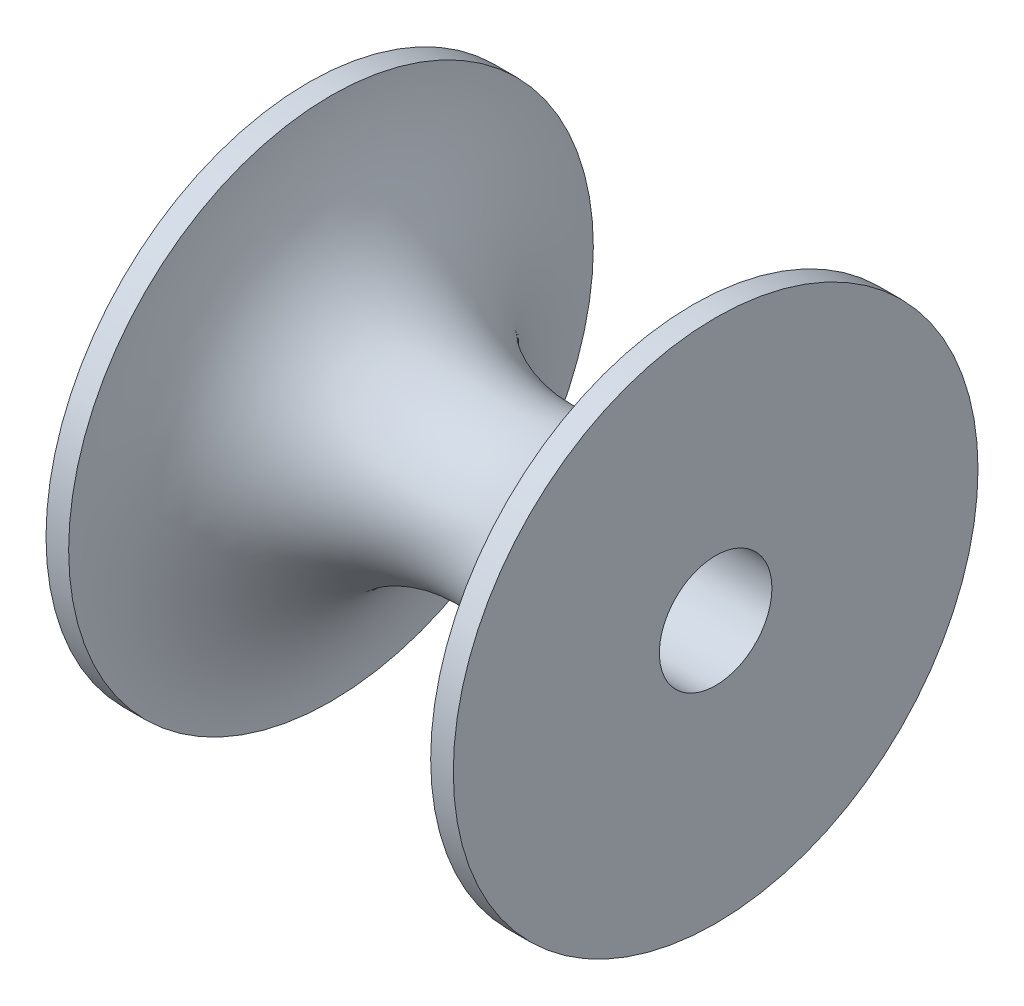
ISO-10303-21;
HEADER;
FILE_DESCRIPTION(('STEP AP214'),'2;1');
FILE_NAME('part.step','',(''),(''),'','','');
FILE_SCHEMA(('AUTOMOTIVE_DESIGN { 1 0 10303 214 1 1 1 1 }'));
ENDSEC;
DATA;
#1=APPLICATION_CONTEXT('core data for automotive mechanical design processes');
#2=APPLICATION_PROTOCOL_DEFINITION('international standard','automotive_design',2000,#1);
#3=PRODUCT_CONTEXT('',#1,'mechanical');
#4=PRODUCT('Part','Part','',(#3));
#5=PRODUCT_RELATED_PRODUCT_CATEGORY('part','',(#4));
#6=PRODUCT_DEFINITION_FORMATION('','',#4);
#7=PRODUCT_DEFINITION_CONTEXT('part definition',#1,'design');
#8=PRODUCT_DEFINITION('design','',#6,#7);
#9=PRODUCT_DEFINITION_SHAPE('','',#8);
#10=(LENGTH_UNIT() NAMED_UNIT(*) SI_UNIT(.MILLI.,.METRE.));
#11=(NAMED_UNIT(*) PLANE_ANGLE_UNIT() SI_UNIT($,.RADIAN.));
#12=(NAMED_UNIT(*) SI_UNIT($,.STERADIAN.) SOLID_ANGLE_UNIT());
#13=UNCERTAINTY_MEASURE_WITH_UNIT(LENGTH_MEASURE(1.E-05),#10,'distance_accuracy_value','');
#14=(GEOMETRIC_REPRESENTATION_CONTEXT(3) GLOBAL_UNCERTAINTY_ASSIGNED_CONTEXT((#13)) GLOBAL_UNIT_ASSIGNED_CONTEXT((#10,
#11,#12)) REPRESENTATION_CONTEXT('',''));
#15=CARTESIAN_POINT('',(0.,0.,0.));
#16=DIRECTION('',(0.,0.,1.));
#17=DIRECTION('',(1.,0.,0.));
#18=AXIS2_PLACEMENT_3D('',#15,#16,#17);
#19=CARTESIAN_POINT('',(0.,0.,-23.19));
#20=DIRECTION('',(-1.,0.,0.));
#21=DIRECTION('',(0.,0.,1.));
#22=AXIS2_PLACEMENT_3D('',#19,#20,#21);
#23=TOROIDAL_SURFACE('',#22,23.19,16.);
#24=CARTESIAN_POINT('',(16.,0.,-23.19));
#25=DIRECTION('',(-1.,0.,0.));
#26=DIRECTION('',(0.,0.,1.));
#27=AXIS2_PLACEMENT_3D('',#24,#25,#26);
#28=CIRCLE('',#27,23.19);
#29=CARTESIAN_POINT('',(16.,0.,0.));
#30=VERTEX_POINT('',#29);
#31=EDGE_CURVE('E49',#30,#30,#28,.T.);
#32=ORIENTED_EDGE('',*,*,#31,.T.);
#33=EDGE_LOOP('',(#32));
#34=FACE_BOUND('',#33,.T.);
#35=CARTESIAN_POINT('',(-16.,0.,-23.19));
#36=DIRECTION('',(-1.,0.,0.));
#37=DIRECTION('',(0.,0.,1.));
#38=AXIS2_PLACEMENT_3D('',#35,#36,#37);
#39=CIRCLE('',#38,23.19);
#40=CARTESIAN_POINT('',(-16.,0.,0.));
#41=VERTEX_POINT('',#40);
#42=EDGE_CURVE('E10',#41,#41,#39,.T.);
#43=ORIENTED_EDGE('',*,*,#42,.F.);
#44=EDGE_LOOP('',(#43));
#45=FACE_BOUND('',#44,.T.);
#46=ADVANCED_FACE('F35',(#34,#45),#23,.F.);
#47=CARTESIAN_POINT('',(-18.,0.,-23.19));
#48=DIRECTION('',(-1.,0.,0.));
#49=DIRECTION('',(0.,0.,1.));
#50=AXIS2_PLACEMENT_3D('',#47,#48,#49);
#51=CYLINDRICAL_SURFACE('',#50,23.19);
#52=ORIENTED_EDGE('',*,*,#42,.T.);
#53=EDGE_LOOP('',(#52));
#54=FACE_BOUND('',#53,.T.);
#55=CARTESIAN_POINT('',(-18.,0.,-23.19));
#56=DIRECTION('',(-1.,0.,0.));
#57=DIRECTION('',(0.,0.,1.));
#58=AXIS2_PLACEMENT_3D('',#55,#56,#57);
#59=CIRCLE('',#58,23.19);
#60=CARTESIAN_POINT('',(-18.,0.,0.));
#61=VERTEX_POINT('',#60);
#62=EDGE_CURVE('E41',#61,#61,#59,.T.);
#63=ORIENTED_EDGE('',*,*,#62,.F.);
#64=EDGE_LOOP('',(#63));
#65=FACE_BOUND('',#64,.T.);
#66=ADVANCED_FACE('F79',(#54,#65),#51,.T.);
#67=CARTESIAN_POINT('',(-18.,0.,0.));
#68=DIRECTION('',(-1.,0.,0.));
#69=DIRECTION('',(0.,0.,1.));
#70=AXIS2_PLACEMENT_3D('',#67,#68,#69);
#71=PLANE('',#70);
#72=CARTESIAN_POINT('',(-18.,0.,-23.19));
#73=DIRECTION('',(-1.,0.,0.));
#74=DIRECTION('',(0.,0.,1.));
#75=AXIS2_PLACEMENT_3D('',#72,#73,#74);
#76=CIRCLE('',#75,4.975);
#77=CARTESIAN_POINT('',(-18.,0.,-18.215));
#78=VERTEX_POINT('',#77);
#79=EDGE_CURVE('E54',#78,#78,#76,.F.);
#80=ORIENTED_EDGE('',*,*,#79,.T.);
#81=EDGE_LOOP('',(#80));
#82=FACE_BOUND('',#81,.T.);
#83=ORIENTED_EDGE('',*,*,#62,.T.);
#84=EDGE_LOOP('',(#83));
#85=FACE_BOUND('',#84,.T.);
#86=ADVANCED_FACE('F68',(#82,#85),#71,.T.);
#87=CARTESIAN_POINT('',(18.,0.,-23.19));
#88=DIRECTION('',(1.,0.,0.));
#89=DIRECTION('',(0.,0.,-1.));
#90=AXIS2_PLACEMENT_3D('',#87,#88,#89);
#91=PLANE('',#90);
#92=CARTESIAN_POINT('',(18.,0.,-23.19));
#93=DIRECTION('',(1.,0.,0.));
#94=DIRECTION('',(0.,0.,-1.));
#95=AXIS2_PLACEMENT_3D('',#92,#93,#94);
#96=CIRCLE('',#95,4.975);
#97=CARTESIAN_POINT('',(18.,0.,-28.165));
#98=VERTEX_POINT('',#97);
#99=EDGE_CURVE('E57',#98,#98,#96,.T.);
#100=ORIENTED_EDGE('',*,*,#99,.F.);
#101=EDGE_LOOP('',(#100));
#102=FACE_BOUND('',#101,.T.);
#103=CARTESIAN_POINT('',(18.,0.,-23.19));
#104=DIRECTION('',(-1.,0.,0.));
#105=DIRECTION('',(0.,0.,1.));
#106=AXIS2_PLACEMENT_3D('',#103,#104,#105);
#107=CIRCLE('',#106,23.19);
#108=CARTESIAN_POINT('',(18.,0.,0.));
#109=VERTEX_POINT('',#108);
#110=EDGE_CURVE('E45',#109,#109,#107,.T.);
#111=ORIENTED_EDGE('',*,*,#110,.F.);
#112=EDGE_LOOP('',(#111));
#113=FACE_BOUND('',#112,.T.);
#114=ADVANCED_FACE('F64',(#102,#113),#91,.T.);
#115=CARTESIAN_POINT('',(-18.,0.,-23.19));
#116=DIRECTION('',(-1.,0.,0.));
#117=DIRECTION('',(0.,0.,1.));
#118=AXIS2_PLACEMENT_3D('',#115,#116,#117);
#119=CYLINDRICAL_SURFACE('',#118,23.19);
#120=ORIENTED_EDGE('',*,*,#110,.T.);
#121=EDGE_LOOP('',(#120));
#122=FACE_BOUND('',#121,.T.);
#123=ORIENTED_EDGE('',*,*,#31,.F.);
#124=EDGE_LOOP('',(#123));
#125=FACE_BOUND('',#124,.T.);
#126=ADVANCED_FACE('F67',(#122,#125),#119,.T.);
#127=CARTESIAN_POINT('',(-32.0714249456123,0.,-23.19));
#128=DIRECTION('',(1.,0.,0.));
#129=DIRECTION('',(0.,0.,-1.));
#130=AXIS2_PLACEMENT_3D('',#127,#128,#129);
#131=CYLINDRICAL_SURFACE('',#130,4.975);
#132=ORIENTED_EDGE('',*,*,#99,.T.);
#133=EDGE_LOOP('',(#132));
#134=FACE_BOUND('',#133,.T.);
#135=ORIENTED_EDGE('',*,*,#79,.F.);
#136=EDGE_LOOP('',(#135));
#137=FACE_BOUND('',#136,.T.);
#138=ADVANCED_FACE('F61',(#134,#137),#131,.F.);
#139=CLOSED_SHELL('',(#46,#66,#86,#114,#126,#138));
#140=MANIFOLD_SOLID_BREP('B2',#139);
#141=ADVANCED_BREP_SHAPE_REPRESENTATION('',(#18,#140),#14);
#142=SHAPE_DEFINITION_REPRESENTATION(#9,#141);
ENDSEC;
END-ISO-10303-21;
